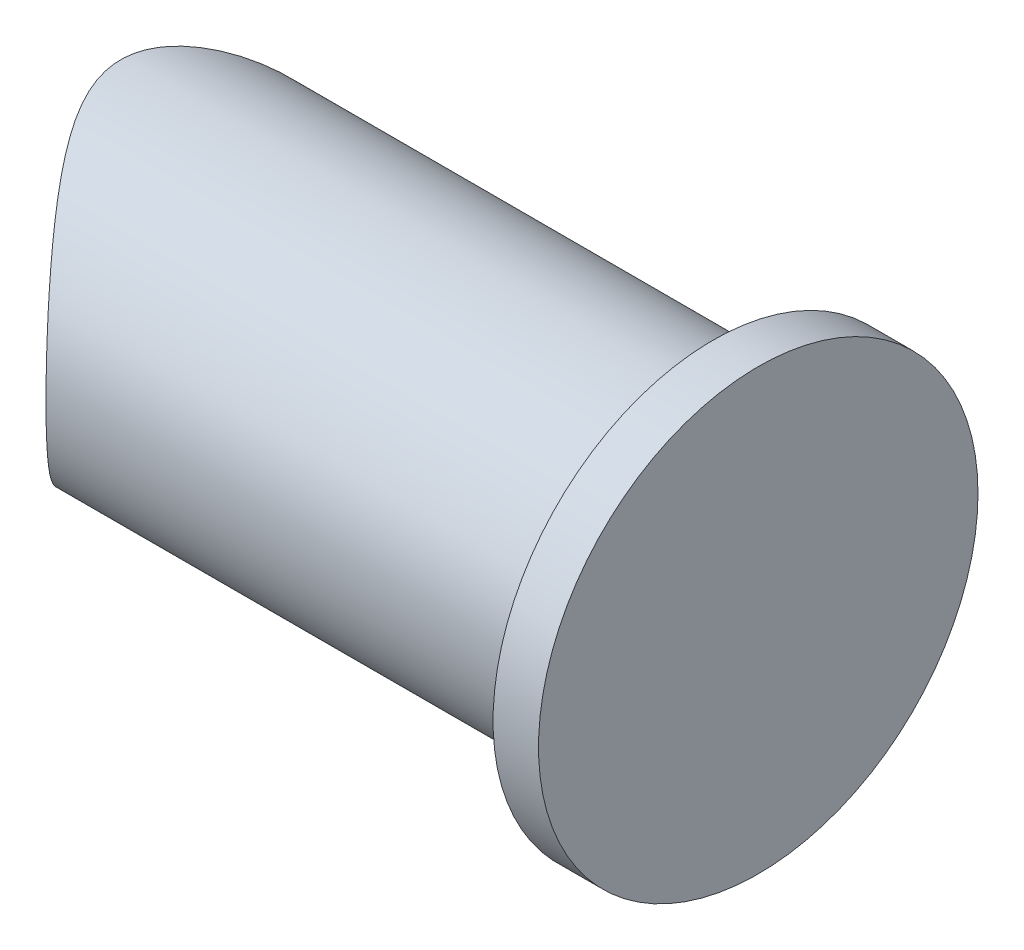
ISO-10303-21;
HEADER;
FILE_DESCRIPTION(('STEP AP214'),'2;1');
FILE_NAME('part.step','',(''),(''),'','','');
FILE_SCHEMA(('AUTOMOTIVE_DESIGN { 1 0 10303 214 1 1 1 1 }'));
ENDSEC;
DATA;
#1=APPLICATION_CONTEXT('core data for automotive mechanical design processes');
#2=APPLICATION_PROTOCOL_DEFINITION('international standard','automotive_design',2000,#1);
#3=PRODUCT_CONTEXT('',#1,'mechanical');
#4=PRODUCT('Part','Part','',(#3));
#5=PRODUCT_RELATED_PRODUCT_CATEGORY('part','',(#4));
#6=PRODUCT_DEFINITION_FORMATION('','',#4);
#7=PRODUCT_DEFINITION_CONTEXT('part definition',#1,'design');
#8=PRODUCT_DEFINITION('design','',#6,#7);
#9=PRODUCT_DEFINITION_SHAPE('','',#8);
#10=(LENGTH_UNIT() NAMED_UNIT(*) SI_UNIT(.MILLI.,.METRE.));
#11=(NAMED_UNIT(*) PLANE_ANGLE_UNIT() SI_UNIT($,.RADIAN.));
#12=(NAMED_UNIT(*) SI_UNIT($,.STERADIAN.) SOLID_ANGLE_UNIT());
#13=UNCERTAINTY_MEASURE_WITH_UNIT(LENGTH_MEASURE(1.E-05),#10,'distance_accuracy_value','');
#14=(GEOMETRIC_REPRESENTATION_CONTEXT(3) GLOBAL_UNCERTAINTY_ASSIGNED_CONTEXT((#13)) GLOBAL_UNIT_ASSIGNED_CONTEXT((#10,
#11,#12)) REPRESENTATION_CONTEXT('',''));
#15=CARTESIAN_POINT('',(0.,0.,0.));
#16=DIRECTION('',(0.,0.,1.));
#17=DIRECTION('',(1.,0.,0.));
#18=AXIS2_PLACEMENT_3D('',#15,#16,#17);
#19=CARTESIAN_POINT('',(-50.,0.,0.));
#20=DIRECTION('',(1.,0.,0.));
#21=DIRECTION('',(0.,0.,-1.));
#22=AXIS2_PLACEMENT_3D('',#19,#20,#21);
#23=CYLINDRICAL_SURFACE('',#22,11.);
#24=CARTESIAN_POINT('',(-33.,0.,-11.));
#25=CARTESIAN_POINT('',(-33.0000012083451,-0.259881411331357,-10.9999987692709));
#26=CARTESIAN_POINT('',(-33.0078093775477,-0.519781831820431,-10.9907740785941));
#27=CARTESIAN_POINT('',(-33.0388673718385,-1.03746326158632,-10.9540427980476));
#28=CARTESIAN_POINT('',(-33.0621245058511,-1.29524320919713,-10.9265275548906));
#29=CARTESIAN_POINT('',(-33.1236031242494,-1.80690801565651,-10.8536620215886));
#30=CARTESIAN_POINT('',(-33.1618504214508,-2.0607853663908,-10.8082809661997));
#31=CARTESIAN_POINT('',(-33.252464428628,-2.56227805600449,-10.7004913044593));
#32=CARTESIAN_POINT('',(-33.3048297830559,-2.80989399357937,-10.6380843328475));
#33=CARTESIAN_POINT('',(-33.4222261238807,-3.29570175651121,-10.4977076609506));
#34=CARTESIAN_POINT('',(-33.4871712512196,-3.53394498787724,-10.4198433745387));
#35=CARTESIAN_POINT('',(-33.6287537208683,-4.00149196066627,-10.2493895574003));
#36=CARTESIAN_POINT('',(-33.7053910882785,-4.2307956828969,-10.1567999950621));
#37=CARTESIAN_POINT('',(-33.8690789827621,-4.6795066536442,-9.9580331455532));
#38=CARTESIAN_POINT('',(-33.9561276923694,-4.89891562026656,-9.85185822969784));
#39=CARTESIAN_POINT('',(-34.1393700486937,-5.32726508239829,-9.62698229653122));
#40=CARTESIAN_POINT('',(-34.2355656612569,-5.53620331274292,-9.50827858593398));
#41=CARTESIAN_POINT('',(-34.4733018853355,-6.01932915297867,-9.2127692071979));
#42=CARTESIAN_POINT('',(-34.6183418685913,-6.28868021951902,-9.03084205161836));
#43=CARTESIAN_POINT('',(-34.9200463437848,-6.80620412294142,-8.64750640366689));
#44=CARTESIAN_POINT('',(-35.0767148643685,-7.05436955554486,-8.44609115234057));
#45=CARTESIAN_POINT('',(-35.3988927056719,-7.52988671484117,-8.02507971348809));
#46=CARTESIAN_POINT('',(-35.564423140564,-7.75718487991017,-7.80543935090283));
#47=CARTESIAN_POINT('',(-35.9007527641543,-8.19026003719393,-7.34972480569378));
#48=CARTESIAN_POINT('',(-36.0715512673928,-8.39603981412483,-7.11365275611339));
#49=CARTESIAN_POINT('',(-36.4184173134671,-8.78996316981531,-6.62102376126765));
#50=CARTESIAN_POINT('',(-36.594522793489,-8.97768715042502,-6.36415825328848));
#51=CARTESIAN_POINT('',(-36.9447788970147,-9.3308523309143,-5.83409498585025));
#52=CARTESIAN_POINT('',(-37.1189288497944,-9.49628608733787,-5.56089181445105));
#53=CARTESIAN_POINT('',(-37.4598719262873,-9.80402007491753,-4.99837815858536));
#54=CARTESIAN_POINT('',(-37.6266806686854,-9.94637134004424,-4.70910516011984));
#55=CARTESIAN_POINT('',(-37.9468314207551,-10.2073006608374,-4.11299804733703));
#56=CARTESIAN_POINT('',(-38.1001845810947,-10.3258985075896,-3.80617882868342));
#57=CARTESIAN_POINT('',(-38.3187058277585,-10.4884146782583,-3.3204106621213));
#58=CARTESIAN_POINT('',(-38.3918190388128,-10.5414791274075,-3.14806049758812));
#59=CARTESIAN_POINT('',(-38.5299126951739,-10.63978207447,-2.79787709878857));
#60=CARTESIAN_POINT('',(-38.5948920466988,-10.6850195201771,-2.62004313109921));
#61=CARTESIAN_POINT('',(-38.7146680207441,-10.7670427247884,-2.25940618047268));
#62=CARTESIAN_POINT('',(-38.7694826365545,-10.803843445943,-2.07661264745251));
#63=CARTESIAN_POINT('',(-38.866999134506,-10.8684740143193,-1.70633011270137));
#64=CARTESIAN_POINT('',(-38.9097074725083,-10.896308643933,-1.51884367181103));
#65=CARTESIAN_POINT('',(-38.9816055060466,-10.9427607352962,-1.13729179920534));
#66=CARTESIAN_POINT('',(-39.0105920769191,-10.9612399696186,-0.94317053932008));
#67=CARTESIAN_POINT('',(-39.0525143084077,-10.9878601588519,-0.552491038321261));
#68=CARTESIAN_POINT('',(-39.0654518518718,-10.9960023264946,-0.355933085810087));
#69=CARTESIAN_POINT('',(-39.0744864277586,-11.0016950326482,0.0376393406199987));
#70=CARTESIAN_POINT('',(-39.0705913205463,-10.9992505148364,0.234653558526949));
#71=CARTESIAN_POINT('',(-39.0462225615207,-10.9838598932249,0.627237844021257));
#72=CARTESIAN_POINT('',(-39.0257472108129,-10.9709127132698,0.822807761546047));
#73=CARTESIAN_POINT('',(-38.9681238279029,-10.9340719463021,1.21967316935082));
#74=CARTESIAN_POINT('',(-38.9302515922457,-10.9097018342865,1.42081772367709));
#75=CARTESIAN_POINT('',(-38.8397876135986,-10.8505420946028,1.81828465379801));
#76=CARTESIAN_POINT('',(-38.7871858538488,-10.8157453752255,2.01460364881386));
#77=CARTESIAN_POINT('',(-38.6695448017123,-10.736361638482,2.40203349561841));
#78=CARTESIAN_POINT('',(-38.6044703384753,-10.6917468819618,2.59312783077659));
#79=CARTESIAN_POINT('',(-38.4643894037815,-10.5934839276356,2.96915132290936));
#80=CARTESIAN_POINT('',(-38.3893847482367,-10.5398373809667,3.1540815993703));
#81=CARTESIAN_POINT('',(-38.1826946126844,-10.3882028076415,3.63054493243602));
#82=CARTESIAN_POINT('',(-38.0446784828541,-10.2833323858427,3.91715320761008));
#83=CARTESIAN_POINT('',(-37.7555991343352,-10.0530634307921,4.47516502168886));
#84=CARTESIAN_POINT('',(-37.6045276580718,-9.92765185959568,4.7465587557568));
#85=CARTESIAN_POINT('',(-37.2946753321266,-9.65710603405165,5.2752803138653));
#86=CARTESIAN_POINT('',(-37.1358839786044,-9.51194439562838,5.53258789982729));
#87=CARTESIAN_POINT('',(-36.8150789731782,-9.20254896234184,6.03321247748276));
#88=CARTESIAN_POINT('',(-36.6530660219007,-9.03831927756432,6.27653246733603));
#89=CARTESIAN_POINT('',(-36.3185632878598,-8.67950657009278,6.76490217240535));
#90=CARTESIAN_POINT('',(-36.1460839575022,-8.48363867357303,7.00901677302634));
#91=CARTESIAN_POINT('',(-35.8048382423504,-8.07034813868884,7.48117027263204));
#92=CARTESIAN_POINT('',(-35.6360723875632,-7.85292244755406,7.70920688698882));
#93=CARTESIAN_POINT('',(-35.3058448120534,-7.39690210884969,8.14774273697243));
#94=CARTESIAN_POINT('',(-35.1443700709806,-7.15834764872732,8.35827384951284));
#95=CARTESIAN_POINT('',(-34.8315186297833,-6.65970291837436,8.76076463154333));
#96=CARTESIAN_POINT('',(-34.6801436691664,-6.39960895554732,8.95272110443222));
#97=CARTESIAN_POINT('',(-34.4210209324993,-5.91491248333516,9.27794535283001));
#98=CARTESIAN_POINT('',(-34.310765979556,-5.69424855949877,9.41509564655788));
#99=CARTESIAN_POINT('',(-34.1003154036998,-5.24023444309949,9.67513959311788));
#100=CARTESIAN_POINT('',(-34.0001141004072,-5.00689153046046,9.79804130266956));
#101=CARTESIAN_POINT('',(-33.8113775895136,-4.52810011955995,10.0283031469999));
#102=CARTESIAN_POINT('',(-33.7228421236154,-4.28265188949172,10.1356636258872));
#103=CARTESIAN_POINT('',(-33.5590921462679,-3.78067413402159,10.3334050739442));
#104=CARTESIAN_POINT('',(-33.4838777847409,-3.52414448394426,10.4237858520165));
#105=CARTESIAN_POINT('',(-33.3477464233589,-2.9991112642727,10.5868576455414));
#106=CARTESIAN_POINT('',(-33.2869637470426,-2.73052091773687,10.6593826816033));
#107=CARTESIAN_POINT('',(-33.1820196310057,-2.18549273660576,10.7843299109106));
#108=CARTESIAN_POINT('',(-33.1378582873225,-1.90905485667764,10.8367519880018));
#109=CARTESIAN_POINT('',(-33.067329424692,-1.35095420532078,10.9203696270421));
#110=CARTESIAN_POINT('',(-33.0409480353332,-1.06929568326701,10.9515817353666));
#111=CARTESIAN_POINT('',(-33.0066546654935,-0.503305485566539,10.9921400449818));
#112=CARTESIAN_POINT('',(-32.9987400005636,-0.218974204484486,11.0014894243883));
#113=CARTESIAN_POINT('',(-33.0013905213502,0.310150151139291,10.998356367698));
#114=CARTESIAN_POINT('',(-33.0095540931664,0.554979619148359,10.9887111787693));
#115=CARTESIAN_POINT('',(-33.0395737437268,1.04259165560286,10.9532068327815));
#116=CARTESIAN_POINT('',(-33.0614283100047,1.28537444714588,10.9273494667076));
#117=CARTESIAN_POINT('',(-33.1183836919107,1.76714774931933,10.8598510935174));
#118=CARTESIAN_POINT('',(-33.1534846090714,2.00613823086723,10.8182099654193));
#119=CARTESIAN_POINT('',(-33.2362503042261,2.47876112023258,10.7197954624541));
#120=CARTESIAN_POINT('',(-33.2839155973078,2.71239330795503,10.6630214672005));
#121=CARTESIAN_POINT('',(-33.3903238686133,3.17028130502384,10.5358970620336));
#122=CARTESIAN_POINT('',(-33.4489325486485,3.394614241892,10.4657110240357));
#123=CARTESIAN_POINT('',(-33.5766439325309,3.83575019681297,10.3122058613816));
#124=CARTESIAN_POINT('',(-33.6457506334619,4.05255030797195,10.2288817339846));
#125=CARTESIAN_POINT('',(-33.7934151374841,4.47771475096264,10.0500378140523));
#126=CARTESIAN_POINT('',(-33.8719728190861,4.68607919118612,9.9545181782853));
#127=CARTESIAN_POINT('',(-34.0374925027079,5.09380521138508,9.7521776655299));
#128=CARTESIAN_POINT('',(-34.1244561990507,5.29316496443721,9.64535450978236));
#129=CARTESIAN_POINT('',(-34.345362775585,5.76754760516511,9.37227578934598));
#130=CARTESIAN_POINT('',(-34.4832274827801,6.03756135172207,9.20044899870409));
#131=CARTESIAN_POINT('',(-34.7710799432589,6.55741659105793,8.83747024594456));
#132=CARTESIAN_POINT('',(-34.9210722283875,6.80725047264278,8.64631105292168));
#133=CARTESIAN_POINT('',(-35.2305138597134,7.28696145586714,8.2460893276099));
#134=CARTESIAN_POINT('',(-35.3899836929871,7.51679246671415,8.03698754260249));
#135=CARTESIAN_POINT('',(-35.7150766649077,7.95581227064905,7.60265767839003));
#136=CARTESIAN_POINT('',(-35.8806990451301,8.16500359644388,7.37743158367537));
#137=CARTESIAN_POINT('',(-36.2181378740197,8.56651547254338,6.90739610897215));
#138=CARTESIAN_POINT('',(-36.3900122242473,8.75845376136411,6.66230218282621));
#139=CARTESIAN_POINT('',(-36.7334742589255,9.12106629522564,6.15654185872991));
#140=CARTESIAN_POINT('',(-36.9050618611759,9.29173522420935,5.89587159162363));
#141=CARTESIAN_POINT('',(-37.2434140201781,9.61125625384057,5.3592122961577));
#142=CARTESIAN_POINT('',(-37.4101856851003,9.76014198231149,5.08324780618685));
#143=CARTESIAN_POINT('',(-37.7337944422772,10.0356806624718,4.51495024610254));
#144=CARTESIAN_POINT('',(-37.8906375243028,10.1623471020315,4.22262724932552));
#145=CARTESIAN_POINT('',(-38.124426821288,10.3434577447123,3.74798266342337));
#146=CARTESIAN_POINT('',(-38.2070963182148,10.4057814878707,3.57145976860271));
#147=CARTESIAN_POINT('',(-38.364993255267,10.522180187291,3.21237543924252));
#148=CARTESIAN_POINT('',(-38.4402193259041,10.5762536265986,3.02981290170583));
#149=CARTESIAN_POINT('',(-38.5810493122841,10.6755135183127,2.65898251846488));
#150=CARTESIAN_POINT('',(-38.6466686472234,10.7207142524145,2.47072441376819));
#151=CARTESIAN_POINT('',(-38.7661015377954,10.8016630865568,2.0885818627102));
#152=CARTESIAN_POINT('',(-38.8199223469262,10.8374169971071,1.8947009566278));
#153=CARTESIAN_POINT('',(-38.9060853498129,10.8939708837357,1.53279867422888));
#154=CARTESIAN_POINT('',(-38.9404729397789,10.9162372339249,1.36549542564254));
#155=CARTESIAN_POINT('',(-38.9978891737336,10.9531555325615,1.02817540483663));
#156=CARTESIAN_POINT('',(-39.0209233432427,10.9678111851949,0.858159994257042));
#157=CARTESIAN_POINT('',(-39.0546435343281,10.9891959471273,0.516553731005449));
#158=CARTESIAN_POINT('',(-39.0653407356492,10.9959322330537,0.344964446957691));
#159=CARTESIAN_POINT('',(-39.0739261486829,11.0013420875578,0.00133378263109256));
#160=CARTESIAN_POINT('',(-39.0718142523661,11.0000155881358,-0.170707601448435));
#161=CARTESIAN_POINT('',(-39.0548839921228,10.9893340703089,-0.513764190792351));
#162=CARTESIAN_POINT('',(-39.0400764117116,10.9799858654095,-0.684780142940065));
#163=CARTESIAN_POINT('',(-38.99846629347,10.9534979030488,-1.02469047126543));
#164=CARTESIAN_POINT('',(-38.9716635204078,10.9363579927881,-1.19358480577031));
#165=CARTESIAN_POINT('',(-38.8747601214614,10.8736818126542,-1.69614163331996));
#166=CARTESIAN_POINT('',(-38.7881842832276,10.8169004401913,-2.025345498194));
#167=CARTESIAN_POINT('',(-38.6039529703954,10.6914951169711,-2.59995796015016));
#168=CARTESIAN_POINT('',(-38.5123623754769,10.6278020790596,-2.84853668535761));
#169=CARTESIAN_POINT('',(-38.3140138370646,10.4852540994183,-3.33522096920386));
#170=CARTESIAN_POINT('',(-38.207246507392,10.4063897641274,-3.57331992629875));
#171=CARTESIAN_POINT('',(-37.9826290730288,10.2343458333337,-4.03982889201694));
#172=CARTESIAN_POINT('',(-37.8647442514271,10.1411207779019,-4.26820508514631));
#173=CARTESIAN_POINT('',(-37.6217226196199,9.94129002383687,-4.714933364102));
#174=CARTESIAN_POINT('',(-37.4965864305252,9.83468547030591,-4.93328630560017));
#175=CARTESIAN_POINT('',(-37.183676379669,9.55687688781298,-5.45803446215848));
#176=CARTESIAN_POINT('',(-36.9933913947409,9.37840228890359,-5.75910591815707));
#177=CARTESIAN_POINT('',(-36.6100437292004,8.99457789591322,-6.34186921226584));
#178=CARTESIAN_POINT('',(-36.4169798537413,8.7892162140379,-6.62355239353955));
#179=CARTESIAN_POINT('',(-36.0336590816291,8.35203467487727,-7.16693411700116));
#180=CARTESIAN_POINT('',(-35.843399039734,8.12024749555638,-7.42865668799169));
#181=CARTESIAN_POINT('',(-35.470136052732,7.62999598369145,-7.93135081216888));
#182=CARTESIAN_POINT('',(-35.287130143209,7.37154270716565,-8.17233088998096));
#183=CARTESIAN_POINT('',(-34.973486686465,6.89046153044004,-8.57884635199192));
#184=CARTESIAN_POINT('',(-34.8404820541999,6.67325715961208,-8.7489899244695));
#185=CARTESIAN_POINT('',(-34.5833843490049,6.2231838933215,-9.07464068713847));
#186=CARTESIAN_POINT('',(-34.459289381482,5.99031834864346,-9.23015099121436));
#187=CARTESIAN_POINT('',(-34.2221644114353,5.50948177283579,-9.52497090197809));
#188=CARTESIAN_POINT('',(-34.1091251583367,5.26152365681749,-9.66429407148693));
#189=CARTESIAN_POINT('',(-33.8961261248213,4.75107011475881,-9.92519203674484));
#190=CARTESIAN_POINT('',(-33.7961636582279,4.48857769011021,-10.0467704781346));
#191=CARTESIAN_POINT('',(-33.6271613822633,3.99607819772838,-10.2513345976664));
#192=CARTESIAN_POINT('',(-33.5557542353512,3.76814568331412,-10.3373668911609));
#193=CARTESIAN_POINT('',(-33.4245802524011,3.30407728172205,-10.4949076448516));
#194=CARTESIAN_POINT('',(-33.3648110418146,3.06794307958766,-10.566419067944));
#195=CARTESIAN_POINT('',(-33.2580845466315,2.58913849128758,-10.6938120765963));
#196=CARTESIAN_POINT('',(-33.2111037126551,2.34648103576662,-10.749722395916));
#197=CARTESIAN_POINT('',(-33.1307495051547,1.85584019560034,-10.8451959020316));
#198=CARTESIAN_POINT('',(-33.0973702932992,1.60785914426281,-10.8847661027235));
#199=CARTESIAN_POINT('',(-33.0475639646951,1.13371443125194,-10.943757161393));
#200=CARTESIAN_POINT('',(-33.0297574830272,0.907898400490242,-10.9648186211846));
#201=CARTESIAN_POINT('',(-33.0059737421399,0.454726636902621,-10.9929420344756));
#202=CARTESIAN_POINT('',(-32.9999989428173,0.227370593753498,-11.0000010767665));
#203=CARTESIAN_POINT('',(-33.,0.,-11.));
#204=B_SPLINE_CURVE_WITH_KNOTS('',3,(#24,#25,#26,#27,#28,#29,#30,#31,#32,#33,#34,#35,#36,#37,
#38,#39,#40,#41,#42,#43,#44,#45,#46,#47,#48,#49,#50,#51,#52,#53,#54,#55,#56,#57,#58,#59,#60,#61,
#62,#63,#64,#65,#66,#67,#68,#69,#70,#71,#72,#73,#74,#75,#76,#77,#78,#79,#80,#81,#82,#83,#84,#85,
#86,#87,#88,#89,#90,#91,#92,#93,#94,#95,#96,#97,#98,#99,#100,#101,#102,#103,#104,#105,#106,#107,
#108,#109,#110,#111,#112,#113,#114,#115,#116,#117,#118,#119,#120,#121,#122,#123,#124,#125,#126,
#127,#128,#129,#130,#131,#132,#133,#134,#135,#136,#137,#138,#139,#140,#141,#142,#143,#144,#145,
#146,#147,#148,#149,#150,#151,#152,#153,#154,#155,#156,#157,#158,#159,#160,#161,#162,#163,#164,
#165,#166,#167,#168,#169,#170,#171,#172,#173,#174,#175,#176,#177,#178,#179,#180,#181,#182,#183,
#184,#185,#186,#187,#188,#189,#190,#191,#192,#193,#194,#195,#196,#197,#198,#199,#200,#201,#202,
#203),.UNSPECIFIED.,.T.,.F.,(4,2,2,2,2,2,2,2,2,2,2,2,2,2,2,2,2,2,2,2,2,2,2,2,2,2,2,2,2,2,2,2,2,
2,2,2,2,2,2,2,2,2,2,2,2,2,2,2,2,2,2,2,2,2,2,2,2,2,2,2,2,2,2,2,2,2,2,2,2,2,2,2,2,2,2,2,2,2,2,2,2,
2,2,2,2,2,2,2,2,4),(0.,0.779399283287929,1.55916756420665,2.34028453493176,3.12132653325466,
3.89721454016366,4.67310421274719,5.44885863853917,6.22478016742462,7.29101875994892,
8.3576284851063,9.4269035895894,10.4960401464162,11.5859183125105,12.6761595283408,
13.7639564150718,14.8508431561576,15.4342914066662,16.0178180309423,16.6003016435506,
17.1824740508333,17.7730139586928,18.3634845787333,18.9536794957296,19.5439348946961,
20.161365429616,20.7792168699392,21.3988368808438,22.0183437393321,23.0215977587593,
24.0254910522307,25.0307907356608,26.0358741292932,27.1069406079803,28.1781589761644,
29.2473819059272,30.3167885174876,31.1627602126878,32.0082512042529,32.8537234723762,
33.6992052552625,34.5522723276276,35.4053443289096,36.2577500631041,37.1100318780679,
37.8445878426546,38.5790626739634,39.3135431351013,40.0480537116058,40.7740811580023,
41.5003857328131,42.2266809722145,42.9531229107444,43.9970376490145,45.0413442973802,
46.087996833697,47.1345207745576,48.2003439919467,49.266433068856,50.330858600464,
51.3946357362766,52.0082475029846,52.6219719567191,53.2347002967712,53.8470508806412,
54.3632781023304,54.8792538361493,55.3947616250991,55.910273761741,56.4253484637392,
56.9404332670548,57.971590739757,58.7879458217457,59.6048079999596,60.4243112714241,
61.243744452365,62.4373371710575,63.6314594156478,64.8241206972836,66.0162894622655,
66.9343859336221,67.8522865948485,68.7694125359381,69.6863497881756,70.4472296410727,
71.2079540846605,71.9672680536114,72.7262557520349,73.4080114982648,74.0899089718254),.UNSPECIFIED.);
#205=CARTESIAN_POINT('',(-33.,0.,-11.));
#206=VERTEX_POINT('',#205);
#207=EDGE_CURVE('E34',#206,#206,#204,.T.);
#208=ORIENTED_EDGE('',*,*,#207,.F.);
#209=EDGE_LOOP('',(#208));
#210=FACE_BOUND('',#209,.T.);
#211=CARTESIAN_POINT('',(0.,0.,0.));
#212=DIRECTION('',(1.,0.,0.));
#213=DIRECTION('',(0.,0.,-1.));
#214=AXIS2_PLACEMENT_3D('',#211,#212,#213);
#215=CIRCLE('',#214,11.);
#216=CARTESIAN_POINT('',(0.,0.,-11.));
#217=VERTEX_POINT('',#216);
#218=EDGE_CURVE('E10',#217,#217,#215,.T.);
#219=ORIENTED_EDGE('',*,*,#218,.F.);
#220=EDGE_LOOP('',(#219));
#221=FACE_BOUND('',#220,.T.);
#222=ADVANCED_FACE('F30',(#210,#221),#23,.T.);
#223=CARTESIAN_POINT('',(-46.,0.,-40.));
#224=DIRECTION('',(0.,0.,1.));
#225=DIRECTION('',(1.,0.,0.));
#226=AXIS2_PLACEMENT_3D('',#223,#224,#225);
#227=CYLINDRICAL_SURFACE('',#226,13.);
#228=ORIENTED_EDGE('',*,*,#207,.T.);
#229=EDGE_LOOP('',(#228));
#230=FACE_BOUND('',#229,.T.);
#231=ADVANCED_FACE('F56',(#230),#227,.F.);
#232=CARTESIAN_POINT('',(3.,0.,0.));
#233=DIRECTION('',(-1.,0.,0.));
#234=DIRECTION('',(0.,0.,1.));
#235=AXIS2_PLACEMENT_3D('',#232,#233,#234);
#236=CYLINDRICAL_SURFACE('',#235,14.5);
#237=CARTESIAN_POINT('',(3.,0.,0.));
#238=DIRECTION('',(1.,0.,0.));
#239=DIRECTION('',(0.,0.,-1.));
#240=AXIS2_PLACEMENT_3D('',#237,#238,#239);
#241=CIRCLE('',#240,14.5);
#242=CARTESIAN_POINT('',(3.,0.,-14.5));
#243=VERTEX_POINT('',#242);
#244=EDGE_CURVE('E43',#243,#243,#241,.T.);
#245=ORIENTED_EDGE('',*,*,#244,.F.);
#246=EDGE_LOOP('',(#245));
#247=FACE_BOUND('',#246,.T.);
#248=CARTESIAN_POINT('',(0.,0.,0.));
#249=DIRECTION('',(1.,0.,0.));
#250=DIRECTION('',(0.,0.,-1.));
#251=AXIS2_PLACEMENT_3D('',#248,#249,#250);
#252=CIRCLE('',#251,14.5);
#253=CARTESIAN_POINT('',(0.,0.,-14.5));
#254=VERTEX_POINT('',#253);
#255=EDGE_CURVE('E45',#254,#254,#252,.T.);
#256=ORIENTED_EDGE('',*,*,#255,.T.);
#257=EDGE_LOOP('',(#256));
#258=FACE_BOUND('',#257,.T.);
#259=ADVANCED_FACE('F53',(#247,#258),#236,.T.);
#260=CARTESIAN_POINT('',(3.,0.,0.));
#261=DIRECTION('',(1.,0.,0.));
#262=DIRECTION('',(0.,0.,-1.));
#263=AXIS2_PLACEMENT_3D('',#260,#261,#262);
#264=PLANE('',#263);
#265=ORIENTED_EDGE('',*,*,#244,.T.);
#266=EDGE_LOOP('',(#265));
#267=FACE_BOUND('',#266,.T.);
#268=ADVANCED_FACE('F51',(#267),#264,.T.);
#269=CARTESIAN_POINT('',(0.,0.,0.));
#270=DIRECTION('',(1.,0.,0.));
#271=DIRECTION('',(0.,0.,-1.));
#272=AXIS2_PLACEMENT_3D('',#269,#270,#271);
#273=PLANE('',#272);
#274=ORIENTED_EDGE('',*,*,#218,.T.);
#275=EDGE_LOOP('',(#274));
#276=FACE_BOUND('',#275,.T.);
#277=ORIENTED_EDGE('',*,*,#255,.F.);
#278=EDGE_LOOP('',(#277));
#279=FACE_BOUND('',#278,.T.);
#280=ADVANCED_FACE('F60',(#276,#279),#273,.F.);
#281=CLOSED_SHELL('',(#222,#231,#259,#268,#280));
#282=MANIFOLD_SOLID_BREP('B2',#281);
#283=ADVANCED_BREP_SHAPE_REPRESENTATION('',(#18,#282),#14);
#284=SHAPE_DEFINITION_REPRESENTATION(#9,#283);
ENDSEC;
END-ISO-10303-21;
